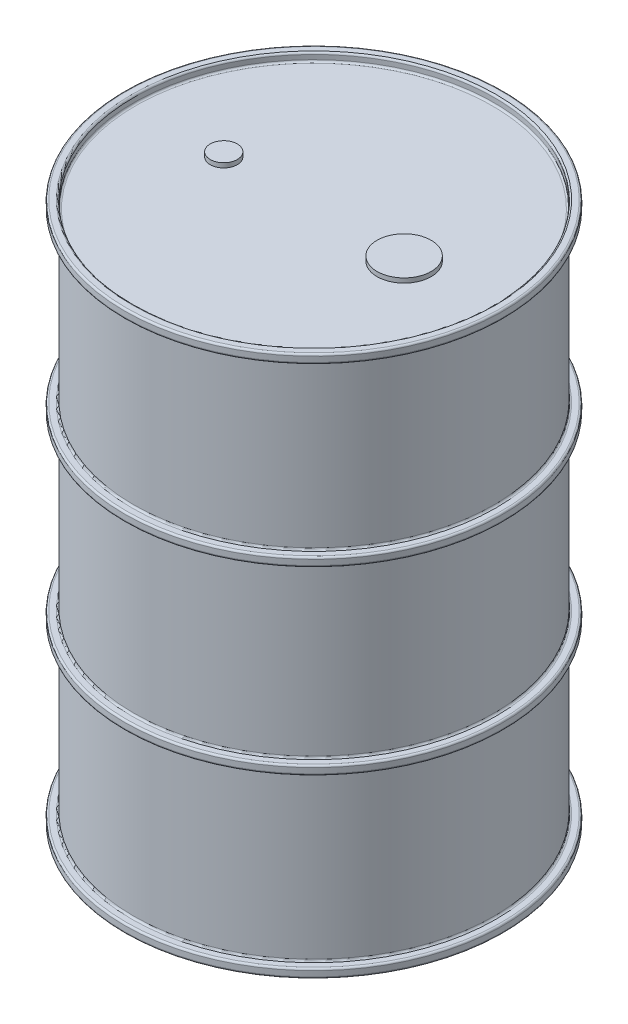
ISO-10303-21;
HEADER;
FILE_DESCRIPTION(('STEP AP214'),'2;1');
FILE_NAME('part.step','',(''),(''),'','','');
FILE_SCHEMA(('AUTOMOTIVE_DESIGN { 1 0 10303 214 1 1 1 1 }'));
ENDSEC;
DATA;
#1=APPLICATION_CONTEXT('core data for automotive mechanical design processes');
#2=APPLICATION_PROTOCOL_DEFINITION('international standard','automotive_design',2000,#1);
#3=PRODUCT_CONTEXT('',#1,'mechanical');
#4=PRODUCT('Part','Part','',(#3));
#5=PRODUCT_RELATED_PRODUCT_CATEGORY('part','',(#4));
#6=PRODUCT_DEFINITION_FORMATION('','',#4);
#7=PRODUCT_DEFINITION_CONTEXT('part definition',#1,'design');
#8=PRODUCT_DEFINITION('design','',#6,#7);
#9=PRODUCT_DEFINITION_SHAPE('','',#8);
#10=(LENGTH_UNIT() NAMED_UNIT(*) SI_UNIT(.MILLI.,.METRE.));
#11=(NAMED_UNIT(*) PLANE_ANGLE_UNIT() SI_UNIT($,.RADIAN.));
#12=(NAMED_UNIT(*) SI_UNIT($,.STERADIAN.) SOLID_ANGLE_UNIT());
#13=UNCERTAINTY_MEASURE_WITH_UNIT(LENGTH_MEASURE(1.E-05),#10,'distance_accuracy_value','');
#14=(GEOMETRIC_REPRESENTATION_CONTEXT(3) GLOBAL_UNCERTAINTY_ASSIGNED_CONTEXT((#13)) GLOBAL_UNIT_ASSIGNED_CONTEXT((#10,
#11,#12)) REPRESENTATION_CONTEXT('',''));
#15=CARTESIAN_POINT('',(0.,0.,0.));
#16=DIRECTION('',(0.,0.,1.));
#17=DIRECTION('',(1.,0.,0.));
#18=AXIS2_PLACEMENT_3D('',#15,#16,#17);
#19=CARTESIAN_POINT('',(0.,29.55,0.));
#20=DIRECTION('',(0.,1.,0.));
#21=DIRECTION('',(0.,0.,1.));
#22=AXIS2_PLACEMENT_3D('',#19,#20,#21);
#23=PLANE('',#22);
#24=CARTESIAN_POINT('',(-5.,29.55,0.));
#25=DIRECTION('',(0.,1.,0.));
#26=DIRECTION('',(0.,0.,1.));
#27=AXIS2_PLACEMENT_3D('',#24,#25,#26);
#28=CIRCLE('',#27,0.749999999999999);
#29=CARTESIAN_POINT('',(-5.,29.55,0.749999999999999));
#30=VERTEX_POINT('',#29);
#31=EDGE_CURVE('E149',#30,#30,#28,.T.);
#32=ORIENTED_EDGE('',*,*,#31,.F.);
#33=EDGE_LOOP('',(#32));
#34=FACE_BOUND('',#33,.T.);
#35=CARTESIAN_POINT('',(0.,29.55,0.));
#36=DIRECTION('',(0.,1.,0.));
#37=DIRECTION('',(0.,0.,1.));
#38=AXIS2_PLACEMENT_3D('',#35,#36,#37);
#39=CIRCLE('',#38,9.9);
#40=CARTESIAN_POINT('',(0.,29.55,9.9));
#41=VERTEX_POINT('',#40);
#42=EDGE_CURVE('E64',#41,#41,#39,.T.);
#43=ORIENTED_EDGE('',*,*,#42,.T.);
#44=EDGE_LOOP('',(#43));
#45=FACE_BOUND('',#44,.T.);
#46=CARTESIAN_POINT('',(5.,29.55,0.));
#47=DIRECTION('',(0.,1.,0.));
#48=DIRECTION('',(0.,0.,1.));
#49=AXIS2_PLACEMENT_3D('',#46,#47,#48);
#50=CIRCLE('',#49,1.5);
#51=CARTESIAN_POINT('',(5.,29.55,1.5));
#52=VERTEX_POINT('',#51);
#53=EDGE_CURVE('E155',#52,#52,#50,.T.);
#54=ORIENTED_EDGE('',*,*,#53,.F.);
#55=EDGE_LOOP('',(#54));
#56=FACE_BOUND('',#55,.T.);
#57=ADVANCED_FACE('F32',(#34,#45,#56),#23,.T.);
#58=CARTESIAN_POINT('',(0.,0.,0.));
#59=DIRECTION('',(0.,1.,0.));
#60=DIRECTION('',(0.,0.,1.));
#61=AXIS2_PLACEMENT_3D('',#58,#59,#60);
#62=PLANE('',#61);
#63=CARTESIAN_POINT('',(0.,0.,0.));
#64=DIRECTION('',(0.,1.,0.));
#65=DIRECTION('',(0.,0.,1.));
#66=AXIS2_PLACEMENT_3D('',#63,#64,#65);
#67=CIRCLE('',#66,10.1);
#68=CARTESIAN_POINT('',(0.,0.,10.1));
#69=VERTEX_POINT('',#68);
#70=EDGE_CURVE('E133',#69,#69,#67,.T.);
#71=ORIENTED_EDGE('',*,*,#70,.T.);
#72=EDGE_LOOP('',(#71));
#73=FACE_BOUND('',#72,.T.);
#74=CARTESIAN_POINT('',(0.,0.,0.));
#75=DIRECTION('',(0.,1.,0.));
#76=DIRECTION('',(0.,0.,1.));
#77=AXIS2_PLACEMENT_3D('',#74,#75,#76);
#78=CIRCLE('',#77,10.4);
#79=CARTESIAN_POINT('',(0.,0.,10.4));
#80=VERTEX_POINT('',#79);
#81=EDGE_CURVE('E136',#80,#80,#78,.F.);
#82=ORIENTED_EDGE('',*,*,#81,.T.);
#83=EDGE_LOOP('',(#82));
#84=FACE_BOUND('',#83,.T.);
#85=ADVANCED_FACE('F171',(#73,#84),#62,.F.);
#86=CARTESIAN_POINT('',(0.,30.,0.));
#87=DIRECTION('',(0.,-1.,0.));
#88=DIRECTION('',(0.,0.,-1.));
#89=AXIS2_PLACEMENT_3D('',#86,#87,#88);
#90=CYLINDRICAL_SURFACE('',#89,10.);
#91=CARTESIAN_POINT('',(0.,20.35,0.));
#92=DIRECTION('',(0.,1.,0.));
#93=DIRECTION('',(0.,0.,1.));
#94=AXIS2_PLACEMENT_3D('',#91,#92,#93);
#95=CIRCLE('',#94,10.);
#96=CARTESIAN_POINT('',(0.,20.35,10.));
#97=VERTEX_POINT('',#96);
#98=EDGE_CURVE('E67',#97,#97,#95,.T.);
#99=ORIENTED_EDGE('',*,*,#98,.T.);
#100=EDGE_LOOP('',(#99));
#101=FACE_BOUND('',#100,.T.);
#102=CARTESIAN_POINT('',(0.,29.4,0.));
#103=DIRECTION('',(0.,1.,0.));
#104=DIRECTION('',(0.,0.,1.));
#105=AXIS2_PLACEMENT_3D('',#102,#103,#104);
#106=CIRCLE('',#105,10.);
#107=CARTESIAN_POINT('',(0.,29.4,10.));
#108=VERTEX_POINT('',#107);
#109=EDGE_CURVE('E70',#108,#108,#106,.F.);
#110=ORIENTED_EDGE('',*,*,#109,.T.);
#111=EDGE_LOOP('',(#110));
#112=FACE_BOUND('',#111,.T.);
#113=ADVANCED_FACE('F177',(#101,#112),#90,.T.);
#114=CARTESIAN_POINT('',(0.,10.35,0.));
#115=DIRECTION('',(0.,1.,0.));
#116=DIRECTION('',(0.,0.,1.));
#117=AXIS2_PLACEMENT_3D('',#114,#115,#116);
#118=CIRCLE('',#117,10.);
#119=CARTESIAN_POINT('',(0.,10.35,10.));
#120=VERTEX_POINT('',#119);
#121=EDGE_CURVE('E91',#120,#120,#118,.T.);
#122=ORIENTED_EDGE('',*,*,#121,.T.);
#123=EDGE_LOOP('',(#122));
#124=FACE_BOUND('',#123,.T.);
#125=CARTESIAN_POINT('',(0.,19.65,0.));
#126=DIRECTION('',(0.,1.,0.));
#127=DIRECTION('',(0.,0.,1.));
#128=AXIS2_PLACEMENT_3D('',#125,#126,#127);
#129=CIRCLE('',#128,10.);
#130=CARTESIAN_POINT('',(0.,19.65,10.));
#131=VERTEX_POINT('',#130);
#132=EDGE_CURVE('E94',#131,#131,#129,.F.);
#133=ORIENTED_EDGE('',*,*,#132,.T.);
#134=EDGE_LOOP('',(#133));
#135=FACE_BOUND('',#134,.T.);
#136=ADVANCED_FACE('F236',(#124,#135),#90,.T.);
#137=CARTESIAN_POINT('',(0.,0.6,0.));
#138=DIRECTION('',(0.,1.,0.));
#139=DIRECTION('',(0.,0.,1.));
#140=AXIS2_PLACEMENT_3D('',#137,#138,#139);
#141=CIRCLE('',#140,10.);
#142=CARTESIAN_POINT('',(0.,0.6,10.));
#143=VERTEX_POINT('',#142);
#144=EDGE_CURVE('E115',#143,#143,#141,.T.);
#145=ORIENTED_EDGE('',*,*,#144,.T.);
#146=EDGE_LOOP('',(#145));
#147=FACE_BOUND('',#146,.T.);
#148=CARTESIAN_POINT('',(0.,9.65,0.));
#149=DIRECTION('',(0.,1.,0.));
#150=DIRECTION('',(0.,0.,1.));
#151=AXIS2_PLACEMENT_3D('',#148,#149,#150);
#152=CIRCLE('',#151,10.);
#153=CARTESIAN_POINT('',(0.,9.65,10.));
#154=VERTEX_POINT('',#153);
#155=EDGE_CURVE('E118',#154,#154,#152,.F.);
#156=ORIENTED_EDGE('',*,*,#155,.T.);
#157=EDGE_LOOP('',(#156));
#158=FACE_BOUND('',#157,.T.);
#159=ADVANCED_FACE('F226',(#147,#158),#90,.T.);
#160=CARTESIAN_POINT('',(0.,0.5,0.));
#161=DIRECTION('',(0.,1.,0.));
#162=DIRECTION('',(0.,0.,1.));
#163=AXIS2_PLACEMENT_3D('',#160,#161,#162);
#164=PLANE('',#163);
#165=CARTESIAN_POINT('',(0.,0.5,0.));
#166=DIRECTION('',(0.,1.,0.));
#167=DIRECTION('',(0.,0.,1.));
#168=AXIS2_PLACEMENT_3D('',#165,#166,#167);
#169=CIRCLE('',#168,10.4);
#170=CARTESIAN_POINT('',(0.,0.5,10.4));
#171=VERTEX_POINT('',#170);
#172=EDGE_CURVE('E121',#171,#171,#169,.T.);
#173=ORIENTED_EDGE('',*,*,#172,.T.);
#174=EDGE_LOOP('',(#173));
#175=FACE_BOUND('',#174,.T.);
#176=CARTESIAN_POINT('',(0.,0.5,0.));
#177=DIRECTION('',(0.,1.,0.));
#178=DIRECTION('',(0.,0.,1.));
#179=AXIS2_PLACEMENT_3D('',#176,#177,#178);
#180=CIRCLE('',#179,10.1);
#181=CARTESIAN_POINT('',(0.,0.5,10.1));
#182=VERTEX_POINT('',#181);
#183=EDGE_CURVE('E124',#182,#182,#180,.F.);
#184=ORIENTED_EDGE('',*,*,#183,.T.);
#185=EDGE_LOOP('',(#184));
#186=FACE_BOUND('',#185,.T.);
#187=ADVANCED_FACE('F223',(#175,#186),#164,.T.);
#188=CARTESIAN_POINT('',(0.,0.5,0.));
#189=DIRECTION('',(0.,-1.,0.));
#190=DIRECTION('',(0.,0.,-1.));
#191=AXIS2_PLACEMENT_3D('',#188,#189,#190);
#192=CYLINDRICAL_SURFACE('',#191,10.5);
#193=CARTESIAN_POINT('',(0.,0.1,0.));
#194=DIRECTION('',(0.,1.,0.));
#195=DIRECTION('',(0.,0.,1.));
#196=AXIS2_PLACEMENT_3D('',#193,#194,#195);
#197=CIRCLE('',#196,10.5);
#198=CARTESIAN_POINT('',(0.,0.1,10.5));
#199=VERTEX_POINT('',#198);
#200=EDGE_CURVE('E127',#199,#199,#197,.T.);
#201=ORIENTED_EDGE('',*,*,#200,.T.);
#202=EDGE_LOOP('',(#201));
#203=FACE_BOUND('',#202,.T.);
#204=CARTESIAN_POINT('',(0.,0.4,0.));
#205=DIRECTION('',(0.,1.,0.));
#206=DIRECTION('',(0.,0.,1.));
#207=AXIS2_PLACEMENT_3D('',#204,#205,#206);
#208=CIRCLE('',#207,10.5);
#209=CARTESIAN_POINT('',(0.,0.4,10.5));
#210=VERTEX_POINT('',#209);
#211=EDGE_CURVE('E130',#210,#210,#208,.F.);
#212=ORIENTED_EDGE('',*,*,#211,.T.);
#213=EDGE_LOOP('',(#212));
#214=FACE_BOUND('',#213,.T.);
#215=ADVANCED_FACE('F215',(#203,#214),#192,.T.);
#216=CARTESIAN_POINT('',(0.,10.25,0.));
#217=DIRECTION('',(0.,1.,0.));
#218=DIRECTION('',(0.,0.,1.));
#219=AXIS2_PLACEMENT_3D('',#216,#217,#218);
#220=PLANE('',#219);
#221=CARTESIAN_POINT('',(0.,10.25,0.));
#222=DIRECTION('',(0.,1.,0.));
#223=DIRECTION('',(0.,0.,1.));
#224=AXIS2_PLACEMENT_3D('',#221,#222,#223);
#225=CIRCLE('',#224,10.4);
#226=CARTESIAN_POINT('',(0.,10.25,10.4));
#227=VERTEX_POINT('',#226);
#228=EDGE_CURVE('E97',#227,#227,#225,.T.);
#229=ORIENTED_EDGE('',*,*,#228,.T.);
#230=EDGE_LOOP('',(#229));
#231=FACE_BOUND('',#230,.T.);
#232=CARTESIAN_POINT('',(0.,10.25,0.));
#233=DIRECTION('',(0.,1.,0.));
#234=DIRECTION('',(0.,0.,1.));
#235=AXIS2_PLACEMENT_3D('',#232,#233,#234);
#236=CIRCLE('',#235,10.1);
#237=CARTESIAN_POINT('',(0.,10.25,10.1));
#238=VERTEX_POINT('',#237);
#239=EDGE_CURVE('E100',#238,#238,#236,.F.);
#240=ORIENTED_EDGE('',*,*,#239,.T.);
#241=EDGE_LOOP('',(#240));
#242=FACE_BOUND('',#241,.T.);
#243=ADVANCED_FACE('F211',(#231,#242),#220,.T.);
#244=CARTESIAN_POINT('',(0.,9.75,0.));
#245=DIRECTION('',(0.,1.,0.));
#246=DIRECTION('',(0.,0.,1.));
#247=AXIS2_PLACEMENT_3D('',#244,#245,#246);
#248=PLANE('',#247);
#249=CARTESIAN_POINT('',(0.,9.75,0.));
#250=DIRECTION('',(0.,1.,0.));
#251=DIRECTION('',(0.,0.,1.));
#252=AXIS2_PLACEMENT_3D('',#249,#250,#251);
#253=CIRCLE('',#252,10.1);
#254=CARTESIAN_POINT('',(0.,9.75,10.1));
#255=VERTEX_POINT('',#254);
#256=EDGE_CURVE('E109',#255,#255,#253,.T.);
#257=ORIENTED_EDGE('',*,*,#256,.T.);
#258=EDGE_LOOP('',(#257));
#259=FACE_BOUND('',#258,.T.);
#260=CARTESIAN_POINT('',(0.,9.75,0.));
#261=DIRECTION('',(0.,1.,0.));
#262=DIRECTION('',(0.,0.,1.));
#263=AXIS2_PLACEMENT_3D('',#260,#261,#262);
#264=CIRCLE('',#263,10.4);
#265=CARTESIAN_POINT('',(0.,9.75,10.4));
#266=VERTEX_POINT('',#265);
#267=EDGE_CURVE('E112',#266,#266,#264,.F.);
#268=ORIENTED_EDGE('',*,*,#267,.T.);
#269=EDGE_LOOP('',(#268));
#270=FACE_BOUND('',#269,.T.);
#271=ADVANCED_FACE('F214',(#259,#270),#248,.F.);
#272=CARTESIAN_POINT('',(0.,10.25,0.));
#273=DIRECTION('',(0.,-1.,0.));
#274=DIRECTION('',(0.,0.,-1.));
#275=AXIS2_PLACEMENT_3D('',#272,#273,#274);
#276=CYLINDRICAL_SURFACE('',#275,10.5);
#277=CARTESIAN_POINT('',(0.,9.85,0.));
#278=DIRECTION('',(0.,1.,0.));
#279=DIRECTION('',(0.,0.,1.));
#280=AXIS2_PLACEMENT_3D('',#277,#278,#279);
#281=CIRCLE('',#280,10.5);
#282=CARTESIAN_POINT('',(0.,9.85,10.5));
#283=VERTEX_POINT('',#282);
#284=EDGE_CURVE('E103',#283,#283,#281,.T.);
#285=ORIENTED_EDGE('',*,*,#284,.T.);
#286=EDGE_LOOP('',(#285));
#287=FACE_BOUND('',#286,.T.);
#288=CARTESIAN_POINT('',(0.,10.15,0.));
#289=DIRECTION('',(0.,1.,0.));
#290=DIRECTION('',(0.,0.,1.));
#291=AXIS2_PLACEMENT_3D('',#288,#289,#290);
#292=CIRCLE('',#291,10.5);
#293=CARTESIAN_POINT('',(0.,10.15,10.5));
#294=VERTEX_POINT('',#293);
#295=EDGE_CURVE('E106',#294,#294,#292,.F.);
#296=ORIENTED_EDGE('',*,*,#295,.T.);
#297=EDGE_LOOP('',(#296));
#298=FACE_BOUND('',#297,.T.);
#299=ADVANCED_FACE('F203',(#287,#298),#276,.T.);
#300=CARTESIAN_POINT('',(0.,20.25,0.));
#301=DIRECTION('',(0.,1.,0.));
#302=DIRECTION('',(0.,0.,1.));
#303=AXIS2_PLACEMENT_3D('',#300,#301,#302);
#304=PLANE('',#303);
#305=CARTESIAN_POINT('',(0.,20.25,0.));
#306=DIRECTION('',(0.,1.,0.));
#307=DIRECTION('',(0.,0.,1.));
#308=AXIS2_PLACEMENT_3D('',#305,#306,#307);
#309=CIRCLE('',#308,10.4);
#310=CARTESIAN_POINT('',(0.,20.25,10.4));
#311=VERTEX_POINT('',#310);
#312=EDGE_CURVE('E73',#311,#311,#309,.T.);
#313=ORIENTED_EDGE('',*,*,#312,.T.);
#314=EDGE_LOOP('',(#313));
#315=FACE_BOUND('',#314,.T.);
#316=CARTESIAN_POINT('',(0.,20.25,0.));
#317=DIRECTION('',(0.,1.,0.));
#318=DIRECTION('',(0.,0.,1.));
#319=AXIS2_PLACEMENT_3D('',#316,#317,#318);
#320=CIRCLE('',#319,10.1);
#321=CARTESIAN_POINT('',(0.,20.25,10.1));
#322=VERTEX_POINT('',#321);
#323=EDGE_CURVE('E76',#322,#322,#320,.F.);
#324=ORIENTED_EDGE('',*,*,#323,.T.);
#325=EDGE_LOOP('',(#324));
#326=FACE_BOUND('',#325,.T.);
#327=ADVANCED_FACE('F199',(#315,#326),#304,.T.);
#328=CARTESIAN_POINT('',(0.,19.75,0.));
#329=DIRECTION('',(0.,1.,0.));
#330=DIRECTION('',(0.,0.,1.));
#331=AXIS2_PLACEMENT_3D('',#328,#329,#330);
#332=PLANE('',#331);
#333=CARTESIAN_POINT('',(0.,19.75,0.));
#334=DIRECTION('',(0.,1.,0.));
#335=DIRECTION('',(0.,0.,1.));
#336=AXIS2_PLACEMENT_3D('',#333,#334,#335);
#337=CIRCLE('',#336,10.1);
#338=CARTESIAN_POINT('',(0.,19.75,10.1));
#339=VERTEX_POINT('',#338);
#340=EDGE_CURVE('E85',#339,#339,#337,.T.);
#341=ORIENTED_EDGE('',*,*,#340,.T.);
#342=EDGE_LOOP('',(#341));
#343=FACE_BOUND('',#342,.T.);
#344=CARTESIAN_POINT('',(0.,19.75,0.));
#345=DIRECTION('',(0.,1.,0.));
#346=DIRECTION('',(0.,0.,1.));
#347=AXIS2_PLACEMENT_3D('',#344,#345,#346);
#348=CIRCLE('',#347,10.4);
#349=CARTESIAN_POINT('',(0.,19.75,10.4));
#350=VERTEX_POINT('',#349);
#351=EDGE_CURVE('E88',#350,#350,#348,.F.);
#352=ORIENTED_EDGE('',*,*,#351,.T.);
#353=EDGE_LOOP('',(#352));
#354=FACE_BOUND('',#353,.T.);
#355=ADVANCED_FACE('F202',(#343,#354),#332,.F.);
#356=CARTESIAN_POINT('',(0.,20.25,0.));
#357=DIRECTION('',(0.,-1.,0.));
#358=DIRECTION('',(0.,0.,-1.));
#359=AXIS2_PLACEMENT_3D('',#356,#357,#358);
#360=CYLINDRICAL_SURFACE('',#359,10.5);
#361=CARTESIAN_POINT('',(0.,19.85,0.));
#362=DIRECTION('',(0.,1.,0.));
#363=DIRECTION('',(0.,0.,1.));
#364=AXIS2_PLACEMENT_3D('',#361,#362,#363);
#365=CIRCLE('',#364,10.5);
#366=CARTESIAN_POINT('',(0.,19.85,10.5));
#367=VERTEX_POINT('',#366);
#368=EDGE_CURVE('E79',#367,#367,#365,.T.);
#369=ORIENTED_EDGE('',*,*,#368,.T.);
#370=EDGE_LOOP('',(#369));
#371=FACE_BOUND('',#370,.T.);
#372=CARTESIAN_POINT('',(0.,20.15,0.));
#373=DIRECTION('',(0.,1.,0.));
#374=DIRECTION('',(0.,0.,1.));
#375=AXIS2_PLACEMENT_3D('',#372,#373,#374);
#376=CIRCLE('',#375,10.5);
#377=CARTESIAN_POINT('',(0.,20.15,10.5));
#378=VERTEX_POINT('',#377);
#379=EDGE_CURVE('E82',#378,#378,#376,.F.);
#380=ORIENTED_EDGE('',*,*,#379,.T.);
#381=EDGE_LOOP('',(#380));
#382=FACE_BOUND('',#381,.T.);
#383=ADVANCED_FACE('F197',(#371,#382),#360,.T.);
#384=CARTESIAN_POINT('',(0.,29.5,0.));
#385=DIRECTION('',(0.,1.,0.));
#386=DIRECTION('',(0.,0.,1.));
#387=AXIS2_PLACEMENT_3D('',#384,#385,#386);
#388=CYLINDRICAL_SURFACE('',#387,10.5);
#389=CARTESIAN_POINT('',(0.,29.9,0.));
#390=DIRECTION('',(0.,1.,0.));
#391=DIRECTION('',(0.,0.,1.));
#392=AXIS2_PLACEMENT_3D('',#389,#390,#391);
#393=CIRCLE('',#392,10.5);
#394=CARTESIAN_POINT('',(0.,29.9,10.5));
#395=VERTEX_POINT('',#394);
#396=EDGE_CURVE('E43',#395,#395,#393,.F.);
#397=ORIENTED_EDGE('',*,*,#396,.T.);
#398=EDGE_LOOP('',(#397));
#399=FACE_BOUND('',#398,.T.);
#400=CARTESIAN_POINT('',(0.,29.6,0.));
#401=DIRECTION('',(0.,1.,0.));
#402=DIRECTION('',(0.,0.,1.));
#403=AXIS2_PLACEMENT_3D('',#400,#401,#402);
#404=CIRCLE('',#403,10.5);
#405=CARTESIAN_POINT('',(0.,29.6,10.5));
#406=VERTEX_POINT('',#405);
#407=EDGE_CURVE('E47',#406,#406,#404,.T.);
#408=ORIENTED_EDGE('',*,*,#407,.T.);
#409=EDGE_LOOP('',(#408));
#410=FACE_BOUND('',#409,.T.);
#411=ADVANCED_FACE('F194',(#399,#410),#388,.T.);
#412=CARTESIAN_POINT('',(0.,29.5,0.));
#413=DIRECTION('',(0.,1.,0.));
#414=DIRECTION('',(0.,0.,1.));
#415=AXIS2_PLACEMENT_3D('',#412,#413,#414);
#416=PLANE('',#415);
#417=CARTESIAN_POINT('',(0.,29.5,0.));
#418=DIRECTION('',(0.,1.,0.));
#419=DIRECTION('',(0.,0.,1.));
#420=AXIS2_PLACEMENT_3D('',#417,#418,#419);
#421=CIRCLE('',#420,10.4);
#422=CARTESIAN_POINT('',(0.,29.5,10.4));
#423=VERTEX_POINT('',#422);
#424=EDGE_CURVE('E10',#423,#423,#421,.F.);
#425=ORIENTED_EDGE('',*,*,#424,.T.);
#426=EDGE_LOOP('',(#425));
#427=FACE_BOUND('',#426,.T.);
#428=CARTESIAN_POINT('',(0.,29.5,0.));
#429=DIRECTION('',(0.,1.,0.));
#430=DIRECTION('',(0.,0.,1.));
#431=AXIS2_PLACEMENT_3D('',#428,#429,#430);
#432=CIRCLE('',#431,10.1);
#433=CARTESIAN_POINT('',(0.,29.5,10.1));
#434=VERTEX_POINT('',#433);
#435=EDGE_CURVE('E39',#434,#434,#432,.T.);
#436=ORIENTED_EDGE('',*,*,#435,.T.);
#437=EDGE_LOOP('',(#436));
#438=FACE_BOUND('',#437,.T.);
#439=ADVANCED_FACE('F191',(#427,#438),#416,.F.);
#440=CARTESIAN_POINT('',(0.,30.,0.));
#441=DIRECTION('',(0.,1.,0.));
#442=DIRECTION('',(0.,0.,1.));
#443=AXIS2_PLACEMENT_3D('',#440,#441,#442);
#444=PLANE('',#443);
#445=CARTESIAN_POINT('',(0.,30.,0.));
#446=DIRECTION('',(0.,1.,0.));
#447=DIRECTION('',(0.,0.,1.));
#448=AXIS2_PLACEMENT_3D('',#445,#446,#447);
#449=CIRCLE('',#448,10.1);
#450=CARTESIAN_POINT('',(0.,30.,10.1));
#451=VERTEX_POINT('',#450);
#452=EDGE_CURVE('E52',#451,#451,#449,.F.);
#453=ORIENTED_EDGE('',*,*,#452,.T.);
#454=EDGE_LOOP('',(#453));
#455=FACE_BOUND('',#454,.T.);
#456=CARTESIAN_POINT('',(0.,30.,0.));
#457=DIRECTION('',(0.,1.,0.));
#458=DIRECTION('',(0.,0.,1.));
#459=AXIS2_PLACEMENT_3D('',#456,#457,#458);
#460=CIRCLE('',#459,10.4);
#461=CARTESIAN_POINT('',(0.,30.,10.4));
#462=VERTEX_POINT('',#461);
#463=EDGE_CURVE('E55',#462,#462,#460,.T.);
#464=ORIENTED_EDGE('',*,*,#463,.T.);
#465=EDGE_LOOP('',(#464));
#466=FACE_BOUND('',#465,.T.);
#467=ADVANCED_FACE('F189',(#455,#466),#444,.T.);
#468=CARTESIAN_POINT('',(0.,29.55,0.));
#469=DIRECTION('',(0.,1.,0.));
#470=DIRECTION('',(0.,0.,1.));
#471=AXIS2_PLACEMENT_3D('',#468,#469,#470);
#472=CYLINDRICAL_SURFACE('',#471,10.);
#473=CARTESIAN_POINT('',(0.,29.65,0.));
#474=DIRECTION('',(0.,1.,0.));
#475=DIRECTION('',(0.,0.,1.));
#476=AXIS2_PLACEMENT_3D('',#473,#474,#475);
#477=CIRCLE('',#476,10.);
#478=CARTESIAN_POINT('',(0.,29.65,10.));
#479=VERTEX_POINT('',#478);
#480=EDGE_CURVE('E58',#479,#479,#477,.F.);
#481=ORIENTED_EDGE('',*,*,#480,.T.);
#482=EDGE_LOOP('',(#481));
#483=FACE_BOUND('',#482,.T.);
#484=CARTESIAN_POINT('',(0.,29.9,0.));
#485=DIRECTION('',(0.,1.,0.));
#486=DIRECTION('',(0.,0.,1.));
#487=AXIS2_PLACEMENT_3D('',#484,#485,#486);
#488=CIRCLE('',#487,10.);
#489=CARTESIAN_POINT('',(0.,29.9,10.));
#490=VERTEX_POINT('',#489);
#491=EDGE_CURVE('E61',#490,#490,#488,.T.);
#492=ORIENTED_EDGE('',*,*,#491,.T.);
#493=EDGE_LOOP('',(#492));
#494=FACE_BOUND('',#493,.T.);
#495=ADVANCED_FACE('F186',(#483,#494),#472,.F.);
#496=CARTESIAN_POINT('',(0.,0.45,0.));
#497=DIRECTION('',(0.,-1.,0.));
#498=DIRECTION('',(0.,0.,-1.));
#499=AXIS2_PLACEMENT_3D('',#496,#497,#498);
#500=CYLINDRICAL_SURFACE('',#499,10.);
#501=CARTESIAN_POINT('',(0.,0.35,0.));
#502=DIRECTION('',(0.,1.,0.));
#503=DIRECTION('',(0.,0.,1.));
#504=AXIS2_PLACEMENT_3D('',#501,#502,#503);
#505=CIRCLE('',#504,10.);
#506=CARTESIAN_POINT('',(0.,0.35,10.));
#507=VERTEX_POINT('',#506);
#508=EDGE_CURVE('E142',#507,#507,#505,.T.);
#509=ORIENTED_EDGE('',*,*,#508,.T.);
#510=EDGE_LOOP('',(#509));
#511=FACE_BOUND('',#510,.T.);
#512=CARTESIAN_POINT('',(0.,0.1,0.));
#513=DIRECTION('',(0.,1.,0.));
#514=DIRECTION('',(0.,0.,1.));
#515=AXIS2_PLACEMENT_3D('',#512,#513,#514);
#516=CIRCLE('',#515,10.);
#517=CARTESIAN_POINT('',(0.,0.1,10.));
#518=VERTEX_POINT('',#517);
#519=EDGE_CURVE('E145',#518,#518,#516,.F.);
#520=ORIENTED_EDGE('',*,*,#519,.T.);
#521=EDGE_LOOP('',(#520));
#522=FACE_BOUND('',#521,.T.);
#523=ADVANCED_FACE('F184',(#511,#522),#500,.F.);
#524=CARTESIAN_POINT('',(0.,0.45,0.));
#525=DIRECTION('',(0.,1.,0.));
#526=DIRECTION('',(0.,0.,1.));
#527=AXIS2_PLACEMENT_3D('',#524,#525,#526);
#528=PLANE('',#527);
#529=CARTESIAN_POINT('',(0.,0.45,0.));
#530=DIRECTION('',(0.,1.,0.));
#531=DIRECTION('',(0.,0.,1.));
#532=AXIS2_PLACEMENT_3D('',#529,#530,#531);
#533=CIRCLE('',#532,9.9);
#534=CARTESIAN_POINT('',(0.,0.45,9.9));
#535=VERTEX_POINT('',#534);
#536=EDGE_CURVE('E139',#535,#535,#533,.F.);
#537=ORIENTED_EDGE('',*,*,#536,.T.);
#538=EDGE_LOOP('',(#537));
#539=FACE_BOUND('',#538,.T.);
#540=ADVANCED_FACE('F242',(#539),#528,.F.);
#541=CARTESIAN_POINT('',(0.,0.35,0.));
#542=DIRECTION('',(0.,1.,0.));
#543=DIRECTION('',(0.,0.,1.));
#544=AXIS2_PLACEMENT_3D('',#541,#542,#543);
#545=TOROIDAL_SURFACE('',#544,9.9,0.1);
#546=ORIENTED_EDGE('',*,*,#536,.F.);
#547=EDGE_LOOP('',(#546));
#548=FACE_BOUND('',#547,.T.);
#549=ORIENTED_EDGE('',*,*,#508,.F.);
#550=EDGE_LOOP('',(#549));
#551=FACE_BOUND('',#550,.T.);
#552=ADVANCED_FACE('F238',(#548,#551),#545,.F.);
#553=CARTESIAN_POINT('',(0.,0.1,0.));
#554=DIRECTION('',(0.,1.,0.));
#555=DIRECTION('',(0.,0.,1.));
#556=AXIS2_PLACEMENT_3D('',#553,#554,#555);
#557=TOROIDAL_SURFACE('',#556,10.1,0.1);
#558=ORIENTED_EDGE('',*,*,#519,.F.);
#559=EDGE_LOOP('',(#558));
#560=FACE_BOUND('',#559,.T.);
#561=ORIENTED_EDGE('',*,*,#70,.F.);
#562=EDGE_LOOP('',(#561));
#563=FACE_BOUND('',#562,.T.);
#564=ADVANCED_FACE('F241',(#560,#563),#557,.T.);
#565=CARTESIAN_POINT('',(0.,0.1,0.));
#566=DIRECTION('',(0.,1.,0.));
#567=DIRECTION('',(0.,0.,1.));
#568=AXIS2_PLACEMENT_3D('',#565,#566,#567);
#569=TOROIDAL_SURFACE('',#568,10.4,0.1);
#570=ORIENTED_EDGE('',*,*,#81,.F.);
#571=EDGE_LOOP('',(#570));
#572=FACE_BOUND('',#571,.T.);
#573=ORIENTED_EDGE('',*,*,#200,.F.);
#574=EDGE_LOOP('',(#573));
#575=FACE_BOUND('',#574,.T.);
#576=ADVANCED_FACE('F246',(#572,#575),#569,.T.);
#577=CARTESIAN_POINT('',(0.,0.4,0.));
#578=DIRECTION('',(0.,1.,0.));
#579=DIRECTION('',(0.,0.,1.));
#580=AXIS2_PLACEMENT_3D('',#577,#578,#579);
#581=TOROIDAL_SURFACE('',#580,10.4,0.1);
#582=ORIENTED_EDGE('',*,*,#211,.F.);
#583=EDGE_LOOP('',(#582));
#584=FACE_BOUND('',#583,.T.);
#585=ORIENTED_EDGE('',*,*,#172,.F.);
#586=EDGE_LOOP('',(#585));
#587=FACE_BOUND('',#586,.T.);
#588=ADVANCED_FACE('F250',(#584,#587),#581,.T.);
#589=CARTESIAN_POINT('',(0.,0.6,0.));
#590=DIRECTION('',(0.,1.,0.));
#591=DIRECTION('',(0.,0.,1.));
#592=AXIS2_PLACEMENT_3D('',#589,#590,#591);
#593=TOROIDAL_SURFACE('',#592,10.1,0.1);
#594=ORIENTED_EDGE('',*,*,#183,.F.);
#595=EDGE_LOOP('',(#594));
#596=FACE_BOUND('',#595,.T.);
#597=ORIENTED_EDGE('',*,*,#144,.F.);
#598=EDGE_LOOP('',(#597));
#599=FACE_BOUND('',#598,.T.);
#600=ADVANCED_FACE('F254',(#596,#599),#593,.F.);
#601=CARTESIAN_POINT('',(0.,9.65,0.));
#602=DIRECTION('',(0.,1.,0.));
#603=DIRECTION('',(0.,0.,1.));
#604=AXIS2_PLACEMENT_3D('',#601,#602,#603);
#605=TOROIDAL_SURFACE('',#604,10.1,0.1);
#606=ORIENTED_EDGE('',*,*,#155,.F.);
#607=EDGE_LOOP('',(#606));
#608=FACE_BOUND('',#607,.T.);
#609=ORIENTED_EDGE('',*,*,#256,.F.);
#610=EDGE_LOOP('',(#609));
#611=FACE_BOUND('',#610,.T.);
#612=ADVANCED_FACE('F258',(#608,#611),#605,.F.);
#613=CARTESIAN_POINT('',(0.,9.85,0.));
#614=DIRECTION('',(0.,1.,0.));
#615=DIRECTION('',(0.,0.,1.));
#616=AXIS2_PLACEMENT_3D('',#613,#614,#615);
#617=TOROIDAL_SURFACE('',#616,10.4,0.1);
#618=ORIENTED_EDGE('',*,*,#267,.F.);
#619=EDGE_LOOP('',(#618));
#620=FACE_BOUND('',#619,.T.);
#621=ORIENTED_EDGE('',*,*,#284,.F.);
#622=EDGE_LOOP('',(#621));
#623=FACE_BOUND('',#622,.T.);
#624=ADVANCED_FACE('F262',(#620,#623),#617,.T.);
#625=CARTESIAN_POINT('',(0.,10.15,0.));
#626=DIRECTION('',(0.,1.,0.));
#627=DIRECTION('',(0.,0.,1.));
#628=AXIS2_PLACEMENT_3D('',#625,#626,#627);
#629=TOROIDAL_SURFACE('',#628,10.4,0.1);
#630=ORIENTED_EDGE('',*,*,#295,.F.);
#631=EDGE_LOOP('',(#630));
#632=FACE_BOUND('',#631,.T.);
#633=ORIENTED_EDGE('',*,*,#228,.F.);
#634=EDGE_LOOP('',(#633));
#635=FACE_BOUND('',#634,.T.);
#636=ADVANCED_FACE('F266',(#632,#635),#629,.T.);
#637=CARTESIAN_POINT('',(0.,10.35,0.));
#638=DIRECTION('',(0.,1.,0.));
#639=DIRECTION('',(0.,0.,1.));
#640=AXIS2_PLACEMENT_3D('',#637,#638,#639);
#641=TOROIDAL_SURFACE('',#640,10.1,0.1);
#642=ORIENTED_EDGE('',*,*,#239,.F.);
#643=EDGE_LOOP('',(#642));
#644=FACE_BOUND('',#643,.T.);
#645=ORIENTED_EDGE('',*,*,#121,.F.);
#646=EDGE_LOOP('',(#645));
#647=FACE_BOUND('',#646,.T.);
#648=ADVANCED_FACE('F270',(#644,#647),#641,.F.);
#649=CARTESIAN_POINT('',(0.,19.65,0.));
#650=DIRECTION('',(0.,1.,0.));
#651=DIRECTION('',(0.,0.,1.));
#652=AXIS2_PLACEMENT_3D('',#649,#650,#651);
#653=TOROIDAL_SURFACE('',#652,10.1,0.1);
#654=ORIENTED_EDGE('',*,*,#132,.F.);
#655=EDGE_LOOP('',(#654));
#656=FACE_BOUND('',#655,.T.);
#657=ORIENTED_EDGE('',*,*,#340,.F.);
#658=EDGE_LOOP('',(#657));
#659=FACE_BOUND('',#658,.T.);
#660=ADVANCED_FACE('F274',(#656,#659),#653,.F.);
#661=CARTESIAN_POINT('',(0.,19.85,0.));
#662=DIRECTION('',(0.,1.,0.));
#663=DIRECTION('',(0.,0.,1.));
#664=AXIS2_PLACEMENT_3D('',#661,#662,#663);
#665=TOROIDAL_SURFACE('',#664,10.4,0.1);
#666=ORIENTED_EDGE('',*,*,#351,.F.);
#667=EDGE_LOOP('',(#666));
#668=FACE_BOUND('',#667,.T.);
#669=ORIENTED_EDGE('',*,*,#368,.F.);
#670=EDGE_LOOP('',(#669));
#671=FACE_BOUND('',#670,.T.);
#672=ADVANCED_FACE('F278',(#668,#671),#665,.T.);
#673=CARTESIAN_POINT('',(0.,20.15,0.));
#674=DIRECTION('',(0.,1.,0.));
#675=DIRECTION('',(0.,0.,1.));
#676=AXIS2_PLACEMENT_3D('',#673,#674,#675);
#677=TOROIDAL_SURFACE('',#676,10.4,0.1);
#678=ORIENTED_EDGE('',*,*,#379,.F.);
#679=EDGE_LOOP('',(#678));
#680=FACE_BOUND('',#679,.T.);
#681=ORIENTED_EDGE('',*,*,#312,.F.);
#682=EDGE_LOOP('',(#681));
#683=FACE_BOUND('',#682,.T.);
#684=ADVANCED_FACE('F282',(#680,#683),#677,.T.);
#685=CARTESIAN_POINT('',(0.,20.35,0.));
#686=DIRECTION('',(0.,1.,0.));
#687=DIRECTION('',(0.,0.,1.));
#688=AXIS2_PLACEMENT_3D('',#685,#686,#687);
#689=TOROIDAL_SURFACE('',#688,10.1,0.1);
#690=ORIENTED_EDGE('',*,*,#323,.F.);
#691=EDGE_LOOP('',(#690));
#692=FACE_BOUND('',#691,.T.);
#693=ORIENTED_EDGE('',*,*,#98,.F.);
#694=EDGE_LOOP('',(#693));
#695=FACE_BOUND('',#694,.T.);
#696=ADVANCED_FACE('F286',(#692,#695),#689,.F.);
#697=CARTESIAN_POINT('',(0.,29.65,0.));
#698=DIRECTION('',(0.,1.,0.));
#699=DIRECTION('',(0.,0.,1.));
#700=AXIS2_PLACEMENT_3D('',#697,#698,#699);
#701=TOROIDAL_SURFACE('',#700,9.9,0.1);
#702=ORIENTED_EDGE('',*,*,#480,.F.);
#703=EDGE_LOOP('',(#702));
#704=FACE_BOUND('',#703,.T.);
#705=ORIENTED_EDGE('',*,*,#42,.F.);
#706=EDGE_LOOP('',(#705));
#707=FACE_BOUND('',#706,.T.);
#708=ADVANCED_FACE('F290',(#704,#707),#701,.F.);
#709=CARTESIAN_POINT('',(0.,29.9,0.));
#710=DIRECTION('',(0.,1.,0.));
#711=DIRECTION('',(0.,0.,1.));
#712=AXIS2_PLACEMENT_3D('',#709,#710,#711);
#713=TOROIDAL_SURFACE('',#712,10.1,0.1);
#714=ORIENTED_EDGE('',*,*,#452,.F.);
#715=EDGE_LOOP('',(#714));
#716=FACE_BOUND('',#715,.T.);
#717=ORIENTED_EDGE('',*,*,#491,.F.);
#718=EDGE_LOOP('',(#717));
#719=FACE_BOUND('',#718,.T.);
#720=ADVANCED_FACE('F294',(#716,#719),#713,.T.);
#721=CARTESIAN_POINT('',(0.,29.9,0.));
#722=DIRECTION('',(0.,1.,0.));
#723=DIRECTION('',(0.,0.,1.));
#724=AXIS2_PLACEMENT_3D('',#721,#722,#723);
#725=TOROIDAL_SURFACE('',#724,10.4,0.1);
#726=ORIENTED_EDGE('',*,*,#396,.F.);
#727=EDGE_LOOP('',(#726));
#728=FACE_BOUND('',#727,.T.);
#729=ORIENTED_EDGE('',*,*,#463,.F.);
#730=EDGE_LOOP('',(#729));
#731=FACE_BOUND('',#730,.T.);
#732=ADVANCED_FACE('F298',(#728,#731),#725,.T.);
#733=CARTESIAN_POINT('',(0.,29.6,0.));
#734=DIRECTION('',(0.,1.,0.));
#735=DIRECTION('',(0.,0.,1.));
#736=AXIS2_PLACEMENT_3D('',#733,#734,#735);
#737=TOROIDAL_SURFACE('',#736,10.4,0.1);
#738=ORIENTED_EDGE('',*,*,#424,.F.);
#739=EDGE_LOOP('',(#738));
#740=FACE_BOUND('',#739,.T.);
#741=ORIENTED_EDGE('',*,*,#407,.F.);
#742=EDGE_LOOP('',(#741));
#743=FACE_BOUND('',#742,.T.);
#744=ADVANCED_FACE('F301',(#740,#743),#737,.T.);
#745=CARTESIAN_POINT('',(0.,29.4,0.));
#746=DIRECTION('',(0.,1.,0.));
#747=DIRECTION('',(0.,0.,1.));
#748=AXIS2_PLACEMENT_3D('',#745,#746,#747);
#749=TOROIDAL_SURFACE('',#748,10.1,0.1);
#750=ORIENTED_EDGE('',*,*,#109,.F.);
#751=EDGE_LOOP('',(#750));
#752=FACE_BOUND('',#751,.T.);
#753=ORIENTED_EDGE('',*,*,#435,.F.);
#754=EDGE_LOOP('',(#753));
#755=FACE_BOUND('',#754,.T.);
#756=ADVANCED_FACE('F34',(#752,#755),#749,.F.);
#757=CARTESIAN_POINT('',(-5.,29.8,0.));
#758=DIRECTION('',(0.,-1.,0.));
#759=DIRECTION('',(0.,0.,-1.));
#760=AXIS2_PLACEMENT_3D('',#757,#758,#759);
#761=CYLINDRICAL_SURFACE('',#760,0.749999999999999);
#762=CARTESIAN_POINT('',(-5.,29.8,0.));
#763=DIRECTION('',(0.,1.,0.));
#764=DIRECTION('',(0.,0.,1.));
#765=AXIS2_PLACEMENT_3D('',#762,#763,#764);
#766=CIRCLE('',#765,0.749999999999999);
#767=CARTESIAN_POINT('',(-5.,29.8,0.749999999999999));
#768=VERTEX_POINT('',#767);
#769=EDGE_CURVE('E148',#768,#768,#766,.T.);
#770=ORIENTED_EDGE('',*,*,#769,.F.);
#771=EDGE_LOOP('',(#770));
#772=FACE_BOUND('',#771,.T.);
#773=ORIENTED_EDGE('',*,*,#31,.T.);
#774=EDGE_LOOP('',(#773));
#775=FACE_BOUND('',#774,.T.);
#776=ADVANCED_FACE('F308',(#772,#775),#761,.T.);
#777=CARTESIAN_POINT('',(-5.,29.8,0.));
#778=DIRECTION('',(0.,1.,0.));
#779=DIRECTION('',(0.,0.,1.));
#780=AXIS2_PLACEMENT_3D('',#777,#778,#779);
#781=PLANE('',#780);
#782=ORIENTED_EDGE('',*,*,#769,.T.);
#783=EDGE_LOOP('',(#782));
#784=FACE_BOUND('',#783,.T.);
#785=ADVANCED_FACE('F166',(#784),#781,.T.);
#786=CARTESIAN_POINT('',(5.,29.8,0.));
#787=DIRECTION('',(0.,-1.,0.));
#788=DIRECTION('',(0.,0.,-1.));
#789=AXIS2_PLACEMENT_3D('',#786,#787,#788);
#790=CYLINDRICAL_SURFACE('',#789,1.5);
#791=CARTESIAN_POINT('',(5.,29.8,0.));
#792=DIRECTION('',(0.,1.,0.));
#793=DIRECTION('',(0.,0.,1.));
#794=AXIS2_PLACEMENT_3D('',#791,#792,#793);
#795=CIRCLE('',#794,1.5);
#796=CARTESIAN_POINT('',(5.,29.8,1.5));
#797=VERTEX_POINT('',#796);
#798=EDGE_CURVE('E152',#797,#797,#795,.T.);
#799=ORIENTED_EDGE('',*,*,#798,.F.);
#800=EDGE_LOOP('',(#799));
#801=FACE_BOUND('',#800,.T.);
#802=ORIENTED_EDGE('',*,*,#53,.T.);
#803=EDGE_LOOP('',(#802));
#804=FACE_BOUND('',#803,.T.);
#805=ADVANCED_FACE('F163',(#801,#804),#790,.T.);
#806=CARTESIAN_POINT('',(5.,29.8,0.));
#807=DIRECTION('',(0.,1.,0.));
#808=DIRECTION('',(0.,0.,1.));
#809=AXIS2_PLACEMENT_3D('',#806,#807,#808);
#810=PLANE('',#809);
#811=ORIENTED_EDGE('',*,*,#798,.T.);
#812=EDGE_LOOP('',(#811));
#813=FACE_BOUND('',#812,.T.);
#814=ADVANCED_FACE('F161',(#813),#810,.T.);
#815=CLOSED_SHELL('',(#57,#85,#113,#136,#159,#187,#215,#243,#271,#299,#327,#355,#383,#411,#439,
#467,#495,#523,#540,#552,#564,#576,#588,#600,#612,#624,#636,#648,#660,#672,#684,#696,#708,#720,
#732,#744,#756,#776,#785,#805,#814));
#816=MANIFOLD_SOLID_BREP('B2',#815);
#817=ADVANCED_BREP_SHAPE_REPRESENTATION('',(#18,#816),#14);
#818=SHAPE_DEFINITION_REPRESENTATION(#9,#817);
ENDSEC;
END-ISO-10303-21;
